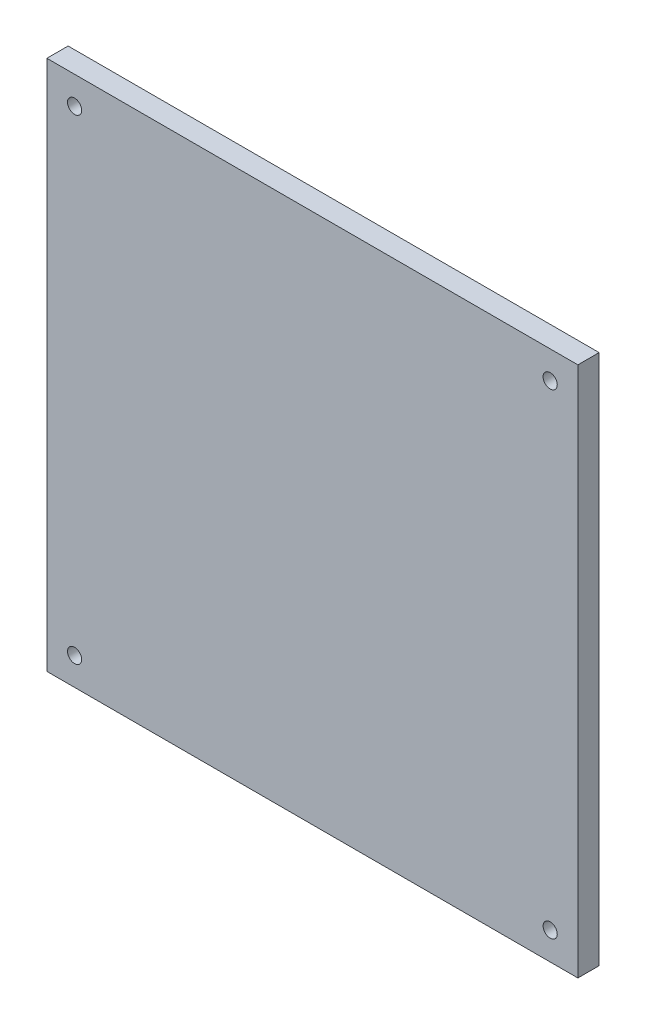
ISO-10303-21;
HEADER;
FILE_DESCRIPTION(('STEP AP214'),'2;1');
FILE_NAME('part.step','',(''),(''),'','','');
FILE_SCHEMA(('AUTOMOTIVE_DESIGN { 1 0 10303 214 1 1 1 1 }'));
ENDSEC;
DATA;
#1=APPLICATION_CONTEXT('core data for automotive mechanical design processes');
#2=APPLICATION_PROTOCOL_DEFINITION('international standard','automotive_design',2000,#1);
#3=PRODUCT_CONTEXT('',#1,'mechanical');
#4=PRODUCT('Part','Part','',(#3));
#5=PRODUCT_RELATED_PRODUCT_CATEGORY('part','',(#4));
#6=PRODUCT_DEFINITION_FORMATION('','',#4);
#7=PRODUCT_DEFINITION_CONTEXT('part definition',#1,'design');
#8=PRODUCT_DEFINITION('design','',#6,#7);
#9=PRODUCT_DEFINITION_SHAPE('','',#8);
#10=(LENGTH_UNIT() NAMED_UNIT(*) SI_UNIT(.MILLI.,.METRE.));
#11=(NAMED_UNIT(*) PLANE_ANGLE_UNIT() SI_UNIT($,.RADIAN.));
#12=(NAMED_UNIT(*) SI_UNIT($,.STERADIAN.) SOLID_ANGLE_UNIT());
#13=UNCERTAINTY_MEASURE_WITH_UNIT(LENGTH_MEASURE(1.E-05),#10,'distance_accuracy_value','');
#14=(GEOMETRIC_REPRESENTATION_CONTEXT(3) GLOBAL_UNCERTAINTY_ASSIGNED_CONTEXT((#13)) GLOBAL_UNIT_ASSIGNED_CONTEXT((#10,
#11,#12)) REPRESENTATION_CONTEXT('',''));
#15=CARTESIAN_POINT('',(0.,0.,0.));
#16=DIRECTION('',(0.,0.,1.));
#17=DIRECTION('',(1.,0.,0.));
#18=AXIS2_PLACEMENT_3D('',#15,#16,#17);
#19=CARTESIAN_POINT('',(0.,-75.,6.));
#20=DIRECTION('',(0.,1.,0.));
#21=DIRECTION('',(0.,0.,1.));
#22=AXIS2_PLACEMENT_3D('',#19,#20,#21);
#23=PLANE('',#22);
#24=DIRECTION('',(1.,0.,0.));
#25=VECTOR('',#24,1.);
#26=CARTESIAN_POINT('',(0.,-75.,0.));
#27=LINE('',#26,#25);
#28=CARTESIAN_POINT('',(-75.,-75.,0.));
#29=VERTEX_POINT('',#28);
#30=CARTESIAN_POINT('',(75.,-75.,0.));
#31=VERTEX_POINT('',#30);
#32=EDGE_CURVE('E112',#29,#31,#27,.T.);
#33=ORIENTED_EDGE('',*,*,#32,.T.);
#34=DIRECTION('',(0.,0.,-1.));
#35=VECTOR('',#34,1.);
#36=CARTESIAN_POINT('',(75.,-75.,6.));
#37=LINE('',#36,#35);
#38=CARTESIAN_POINT('',(75.,-75.,6.));
#39=VERTEX_POINT('',#38);
#40=EDGE_CURVE('E11',#39,#31,#37,.T.);
#41=ORIENTED_EDGE('',*,*,#40,.F.);
#42=DIRECTION('',(1.,0.,0.));
#43=VECTOR('',#42,1.);
#44=CARTESIAN_POINT('',(0.,-75.,6.));
#45=LINE('',#44,#43);
#46=CARTESIAN_POINT('',(-75.,-75.,6.));
#47=VERTEX_POINT('',#46);
#48=EDGE_CURVE('E93',#47,#39,#45,.T.);
#49=ORIENTED_EDGE('',*,*,#48,.F.);
#50=DIRECTION('',(0.,0.,-1.));
#51=VECTOR('',#50,1.);
#52=CARTESIAN_POINT('',(-75.,-75.,6.));
#53=LINE('',#52,#51);
#54=EDGE_CURVE('E60',#47,#29,#53,.T.);
#55=ORIENTED_EDGE('',*,*,#54,.T.);
#56=EDGE_LOOP('',(#33,#41,#49,#55));
#57=FACE_BOUND('',#56,.T.);
#58=ADVANCED_FACE('F41',(#57),#23,.F.);
#59=CARTESIAN_POINT('',(75.,0.,6.));
#60=DIRECTION('',(-1.,0.,0.));
#61=DIRECTION('',(0.,0.,1.));
#62=AXIS2_PLACEMENT_3D('',#59,#60,#61);
#63=PLANE('',#62);
#64=DIRECTION('',(0.,1.,0.));
#65=VECTOR('',#64,1.);
#66=CARTESIAN_POINT('',(75.,0.,0.));
#67=LINE('',#66,#65);
#68=CARTESIAN_POINT('',(75.,75.,0.));
#69=VERTEX_POINT('',#68);
#70=EDGE_CURVE('E99',#31,#69,#67,.T.);
#71=ORIENTED_EDGE('',*,*,#70,.T.);
#72=DIRECTION('',(0.,0.,-1.));
#73=VECTOR('',#72,1.);
#74=CARTESIAN_POINT('',(75.,75.,6.));
#75=LINE('',#74,#73);
#76=CARTESIAN_POINT('',(75.,75.,6.));
#77=VERTEX_POINT('',#76);
#78=EDGE_CURVE('E51',#77,#69,#75,.T.);
#79=ORIENTED_EDGE('',*,*,#78,.F.);
#80=DIRECTION('',(0.,1.,0.));
#81=VECTOR('',#80,1.);
#82=CARTESIAN_POINT('',(75.,0.,6.));
#83=LINE('',#82,#81);
#84=EDGE_CURVE('E85',#39,#77,#83,.T.);
#85=ORIENTED_EDGE('',*,*,#84,.F.);
#86=ORIENTED_EDGE('',*,*,#40,.T.);
#87=EDGE_LOOP('',(#71,#79,#85,#86));
#88=FACE_BOUND('',#87,.T.);
#89=ADVANCED_FACE('F98',(#88),#63,.F.);
#90=CARTESIAN_POINT('',(0.,75.,6.));
#91=DIRECTION('',(0.,1.,0.));
#92=DIRECTION('',(0.,0.,1.));
#93=AXIS2_PLACEMENT_3D('',#90,#91,#92);
#94=PLANE('',#93);
#95=DIRECTION('',(1.,0.,0.));
#96=VECTOR('',#95,1.);
#97=CARTESIAN_POINT('',(0.,75.,0.));
#98=LINE('',#97,#96);
#99=CARTESIAN_POINT('',(-75.,75.,0.));
#100=VERTEX_POINT('',#99);
#101=EDGE_CURVE('E117',#100,#69,#98,.T.);
#102=ORIENTED_EDGE('',*,*,#101,.F.);
#103=DIRECTION('',(0.,0.,-1.));
#104=VECTOR('',#103,1.);
#105=CARTESIAN_POINT('',(-75.,75.,6.));
#106=LINE('',#105,#104);
#107=CARTESIAN_POINT('',(-75.,75.,6.));
#108=VERTEX_POINT('',#107);
#109=EDGE_CURVE('E74',#108,#100,#106,.T.);
#110=ORIENTED_EDGE('',*,*,#109,.F.);
#111=DIRECTION('',(1.,0.,0.));
#112=VECTOR('',#111,1.);
#113=CARTESIAN_POINT('',(0.,75.,6.));
#114=LINE('',#113,#112);
#115=EDGE_CURVE('E92',#108,#77,#114,.T.);
#116=ORIENTED_EDGE('',*,*,#115,.T.);
#117=ORIENTED_EDGE('',*,*,#78,.T.);
#118=EDGE_LOOP('',(#102,#110,#116,#117));
#119=FACE_BOUND('',#118,.T.);
#120=ADVANCED_FACE('F104',(#119),#94,.T.);
#121=CARTESIAN_POINT('',(-75.,0.,6.));
#122=DIRECTION('',(-1.,0.,0.));
#123=DIRECTION('',(0.,0.,1.));
#124=AXIS2_PLACEMENT_3D('',#121,#122,#123);
#125=PLANE('',#124);
#126=DIRECTION('',(0.,1.,0.));
#127=VECTOR('',#126,1.);
#128=CARTESIAN_POINT('',(-75.,0.,0.));
#129=LINE('',#128,#127);
#130=EDGE_CURVE('E120',#29,#100,#129,.T.);
#131=ORIENTED_EDGE('',*,*,#130,.F.);
#132=ORIENTED_EDGE('',*,*,#54,.F.);
#133=DIRECTION('',(0.,1.,0.));
#134=VECTOR('',#133,1.);
#135=CARTESIAN_POINT('',(-75.,0.,6.));
#136=LINE('',#135,#134);
#137=EDGE_CURVE('E106',#47,#108,#136,.T.);
#138=ORIENTED_EDGE('',*,*,#137,.T.);
#139=ORIENTED_EDGE('',*,*,#109,.T.);
#140=EDGE_LOOP('',(#131,#132,#138,#139));
#141=FACE_BOUND('',#140,.T.);
#142=ADVANCED_FACE('F165',(#141),#125,.T.);
#143=CARTESIAN_POINT('',(0.,0.,6.));
#144=DIRECTION('',(0.,0.,1.));
#145=DIRECTION('',(1.,0.,0.));
#146=AXIS2_PLACEMENT_3D('',#143,#144,#145);
#147=PLANE('',#146);
#148=CARTESIAN_POINT('',(-67.1751442127221,67.1751442126973,6.));
#149=DIRECTION('',(0.,0.,1.));
#150=DIRECTION('',(1.,0.,0.));
#151=AXIS2_PLACEMENT_3D('',#148,#149,#150);
#152=CIRCLE('',#151,2.00000000002405);
#153=CARTESIAN_POINT('',(-65.175144212698,67.1751442126973,6.));
#154=VERTEX_POINT('',#153);
#155=EDGE_CURVE('E199',#154,#154,#152,.T.);
#156=ORIENTED_EDGE('',*,*,#155,.F.);
#157=EDGE_LOOP('',(#156));
#158=FACE_BOUND('',#157,.T.);
#159=CARTESIAN_POINT('',(-67.1751442126974,-67.1751442127467,6.));
#160=DIRECTION('',(0.,0.,1.));
#161=DIRECTION('',(1.,0.,0.));
#162=AXIS2_PLACEMENT_3D('',#159,#160,#161);
#163=CIRCLE('',#162,2.00000000001663);
#164=CARTESIAN_POINT('',(-65.1751442126808,-67.1751442127467,6.));
#165=VERTEX_POINT('',#164);
#166=EDGE_CURVE('E196',#165,#165,#163,.T.);
#167=ORIENTED_EDGE('',*,*,#166,.F.);
#168=EDGE_LOOP('',(#167));
#169=FACE_BOUND('',#168,.T.);
#170=CARTESIAN_POINT('',(67.1751442127467,-67.1751442127221,6.));
#171=DIRECTION('',(0.,0.,1.));
#172=DIRECTION('',(1.,0.,0.));
#173=AXIS2_PLACEMENT_3D('',#170,#171,#172);
#174=CIRCLE('',#173,1.99999999999289);
#175=CARTESIAN_POINT('',(69.1751442127396,-67.1751442127221,6.));
#176=VERTEX_POINT('',#175);
#177=EDGE_CURVE('E192',#176,#176,#174,.T.);
#178=ORIENTED_EDGE('',*,*,#177,.F.);
#179=EDGE_LOOP('',(#178));
#180=FACE_BOUND('',#179,.T.);
#181=CARTESIAN_POINT('',(67.175144212722,67.175144212722,6.));
#182=DIRECTION('',(0.,0.,1.));
#183=DIRECTION('',(1.,0.,0.));
#184=AXIS2_PLACEMENT_3D('',#181,#182,#183);
#185=CIRCLE('',#184,2.);
#186=CARTESIAN_POINT('',(69.175144212722,67.175144212722,6.));
#187=VERTEX_POINT('',#186);
#188=EDGE_CURVE('E133',#187,#187,#185,.T.);
#189=ORIENTED_EDGE('',*,*,#188,.F.);
#190=EDGE_LOOP('',(#189));
#191=FACE_BOUND('',#190,.T.);
#192=ORIENTED_EDGE('',*,*,#48,.T.);
#193=ORIENTED_EDGE('',*,*,#84,.T.);
#194=ORIENTED_EDGE('',*,*,#115,.F.);
#195=ORIENTED_EDGE('',*,*,#137,.F.);
#196=EDGE_LOOP('',(#192,#193,#194,#195));
#197=FACE_BOUND('',#196,.T.);
#198=ADVANCED_FACE('F89',(#158,#169,#180,#191,#197),#147,.T.);
#199=CARTESIAN_POINT('',(0.,0.,0.));
#200=DIRECTION('',(0.,0.,1.));
#201=DIRECTION('',(1.,0.,0.));
#202=AXIS2_PLACEMENT_3D('',#199,#200,#201);
#203=PLANE('',#202);
#204=CARTESIAN_POINT('',(-67.1751442127221,67.1751442126973,0.));
#205=DIRECTION('',(0.,0.,1.));
#206=DIRECTION('',(1.,0.,0.));
#207=AXIS2_PLACEMENT_3D('',#204,#205,#206);
#208=CIRCLE('',#207,2.00000000002405);
#209=CARTESIAN_POINT('',(-65.175144212698,67.1751442126973,0.));
#210=VERTEX_POINT('',#209);
#211=EDGE_CURVE('E44',#210,#210,#208,.T.);
#212=ORIENTED_EDGE('',*,*,#211,.T.);
#213=EDGE_LOOP('',(#212));
#214=FACE_BOUND('',#213,.T.);
#215=CARTESIAN_POINT('',(-67.1751442126974,-67.1751442127467,0.));
#216=DIRECTION('',(0.,0.,1.));
#217=DIRECTION('',(1.,0.,0.));
#218=AXIS2_PLACEMENT_3D('',#215,#216,#217);
#219=CIRCLE('',#218,2.00000000001663);
#220=CARTESIAN_POINT('',(-65.1751442126808,-67.1751442127467,0.));
#221=VERTEX_POINT('',#220);
#222=EDGE_CURVE('E136',#221,#221,#219,.T.);
#223=ORIENTED_EDGE('',*,*,#222,.T.);
#224=EDGE_LOOP('',(#223));
#225=FACE_BOUND('',#224,.T.);
#226=CARTESIAN_POINT('',(67.1751442127467,-67.1751442127221,0.));
#227=DIRECTION('',(0.,0.,1.));
#228=DIRECTION('',(1.,0.,0.));
#229=AXIS2_PLACEMENT_3D('',#226,#227,#228);
#230=CIRCLE('',#229,1.99999999999289);
#231=CARTESIAN_POINT('',(69.1751442127396,-67.1751442127221,0.));
#232=VERTEX_POINT('',#231);
#233=EDGE_CURVE('E132',#232,#232,#230,.T.);
#234=ORIENTED_EDGE('',*,*,#233,.T.);
#235=EDGE_LOOP('',(#234));
#236=FACE_BOUND('',#235,.T.);
#237=CARTESIAN_POINT('',(67.175144212722,67.175144212722,0.));
#238=DIRECTION('',(0.,0.,1.));
#239=DIRECTION('',(1.,0.,0.));
#240=AXIS2_PLACEMENT_3D('',#237,#238,#239);
#241=CIRCLE('',#240,2.);
#242=CARTESIAN_POINT('',(69.175144212722,67.175144212722,0.));
#243=VERTEX_POINT('',#242);
#244=EDGE_CURVE('E128',#243,#243,#241,.T.);
#245=ORIENTED_EDGE('',*,*,#244,.T.);
#246=EDGE_LOOP('',(#245));
#247=FACE_BOUND('',#246,.T.);
#248=ORIENTED_EDGE('',*,*,#32,.F.);
#249=ORIENTED_EDGE('',*,*,#130,.T.);
#250=ORIENTED_EDGE('',*,*,#101,.T.);
#251=ORIENTED_EDGE('',*,*,#70,.F.);
#252=EDGE_LOOP('',(#248,#249,#250,#251));
#253=FACE_BOUND('',#252,.T.);
#254=ADVANCED_FACE('F145',(#214,#225,#236,#247,#253),#203,.F.);
#255=CARTESIAN_POINT('',(67.175144212722,67.175144212722,-4.));
#256=DIRECTION('',(0.,0.,1.));
#257=DIRECTION('',(1.,0.,0.));
#258=AXIS2_PLACEMENT_3D('',#255,#256,#257);
#259=CYLINDRICAL_SURFACE('',#258,2.);
#260=ORIENTED_EDGE('',*,*,#188,.T.);
#261=EDGE_LOOP('',(#260));
#262=FACE_BOUND('',#261,.T.);
#263=ORIENTED_EDGE('',*,*,#244,.F.);
#264=EDGE_LOOP('',(#263));
#265=FACE_BOUND('',#264,.T.);
#266=ADVANCED_FACE('F177',(#262,#265),#259,.F.);
#267=CARTESIAN_POINT('',(67.1751442127467,-67.1751442127221,-4.));
#268=DIRECTION('',(0.,0.,1.));
#269=DIRECTION('',(1.,0.,0.));
#270=AXIS2_PLACEMENT_3D('',#267,#268,#269);
#271=CYLINDRICAL_SURFACE('',#270,1.99999999999289);
#272=ORIENTED_EDGE('',*,*,#177,.T.);
#273=EDGE_LOOP('',(#272));
#274=FACE_BOUND('',#273,.T.);
#275=ORIENTED_EDGE('',*,*,#233,.F.);
#276=EDGE_LOOP('',(#275));
#277=FACE_BOUND('',#276,.T.);
#278=ADVANCED_FACE('F155',(#274,#277),#271,.F.);
#279=CARTESIAN_POINT('',(-67.1751442126974,-67.1751442127467,-4.));
#280=DIRECTION('',(0.,0.,1.));
#281=DIRECTION('',(1.,0.,0.));
#282=AXIS2_PLACEMENT_3D('',#279,#280,#281);
#283=CYLINDRICAL_SURFACE('',#282,2.00000000001663);
#284=ORIENTED_EDGE('',*,*,#166,.T.);
#285=EDGE_LOOP('',(#284));
#286=FACE_BOUND('',#285,.T.);
#287=ORIENTED_EDGE('',*,*,#222,.F.);
#288=EDGE_LOOP('',(#287));
#289=FACE_BOUND('',#288,.T.);
#290=ADVANCED_FACE('F149',(#286,#289),#283,.F.);
#291=CARTESIAN_POINT('',(-67.1751442127221,67.1751442126973,-4.));
#292=DIRECTION('',(0.,0.,1.));
#293=DIRECTION('',(1.,0.,0.));
#294=AXIS2_PLACEMENT_3D('',#291,#292,#293);
#295=CYLINDRICAL_SURFACE('',#294,2.00000000002405);
#296=ORIENTED_EDGE('',*,*,#155,.T.);
#297=EDGE_LOOP('',(#296));
#298=FACE_BOUND('',#297,.T.);
#299=ORIENTED_EDGE('',*,*,#211,.F.);
#300=EDGE_LOOP('',(#299));
#301=FACE_BOUND('',#300,.T.);
#302=ADVANCED_FACE('F147',(#298,#301),#295,.F.);
#303=CLOSED_SHELL('',(#58,#89,#120,#142,#198,#254,#266,#278,#290,#302));
#304=MANIFOLD_SOLID_BREP('B2',#303);
#305=ADVANCED_BREP_SHAPE_REPRESENTATION('',(#18,#304),#14);
#306=SHAPE_DEFINITION_REPRESENTATION(#9,#305);
ENDSEC;
END-ISO-10303-21;
